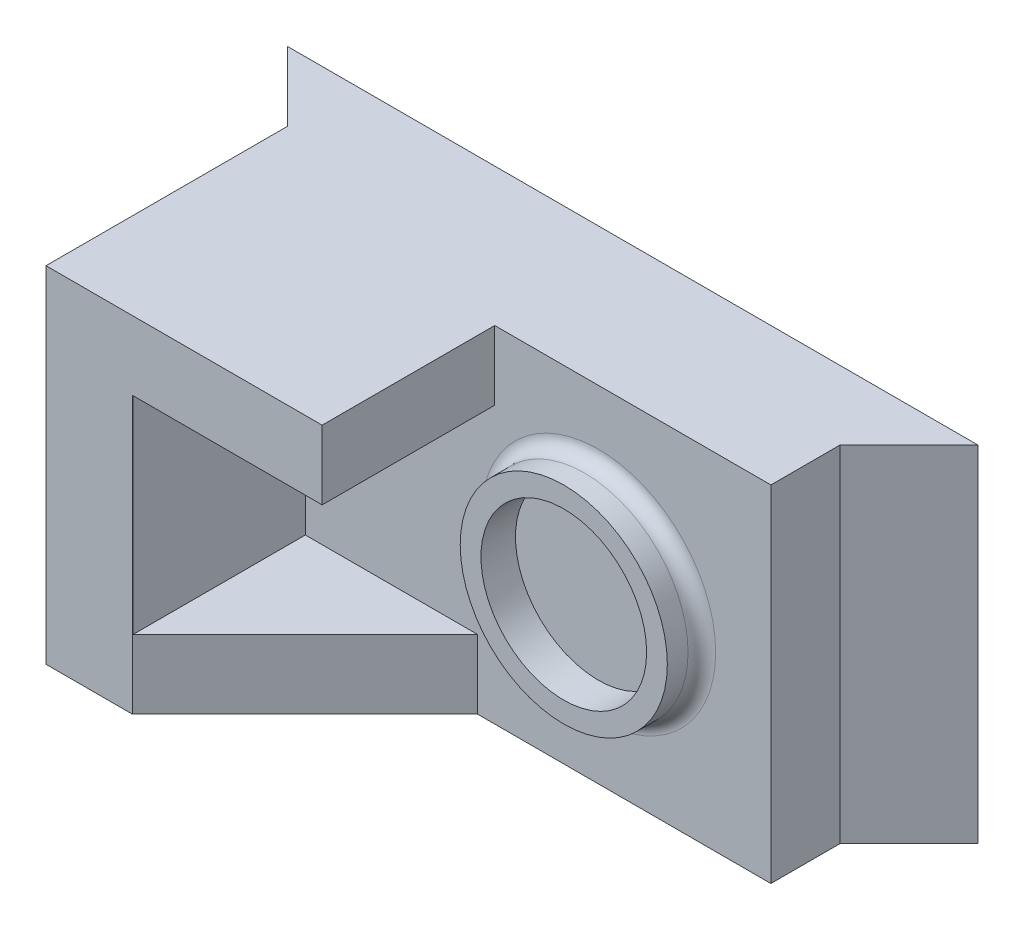
ISO-10303-21;
HEADER;
FILE_DESCRIPTION(('STEP AP214'),'2;1');
FILE_NAME('part.step','',(''),(''),'','','');
FILE_SCHEMA(('AUTOMOTIVE_DESIGN { 1 0 10303 214 1 1 1 1 }'));
ENDSEC;
DATA;
#1=APPLICATION_CONTEXT('core data for automotive mechanical design processes');
#2=APPLICATION_PROTOCOL_DEFINITION('international standard','automotive_design',2000,#1);
#3=PRODUCT_CONTEXT('',#1,'mechanical');
#4=PRODUCT('Part','Part','',(#3));
#5=PRODUCT_RELATED_PRODUCT_CATEGORY('part','',(#4));
#6=PRODUCT_DEFINITION_FORMATION('','',#4);
#7=PRODUCT_DEFINITION_CONTEXT('part definition',#1,'design');
#8=PRODUCT_DEFINITION('design','',#6,#7);
#9=PRODUCT_DEFINITION_SHAPE('','',#8);
#10=(LENGTH_UNIT() NAMED_UNIT(*) SI_UNIT(.MILLI.,.METRE.));
#11=(NAMED_UNIT(*) PLANE_ANGLE_UNIT() SI_UNIT($,.RADIAN.));
#12=(NAMED_UNIT(*) SI_UNIT($,.STERADIAN.) SOLID_ANGLE_UNIT());
#13=UNCERTAINTY_MEASURE_WITH_UNIT(LENGTH_MEASURE(1.E-05),#10,'distance_accuracy_value','');
#14=(GEOMETRIC_REPRESENTATION_CONTEXT(3) GLOBAL_UNCERTAINTY_ASSIGNED_CONTEXT((#13)) GLOBAL_UNIT_ASSIGNED_CONTEXT((#10,
#11,#12)) REPRESENTATION_CONTEXT('',''));
#15=CARTESIAN_POINT('',(0.,0.,0.));
#16=DIRECTION('',(0.,0.,1.));
#17=DIRECTION('',(1.,0.,0.));
#18=AXIS2_PLACEMENT_3D('',#15,#16,#17);
#19=CARTESIAN_POINT('',(0.,25.,45.));
#20=DIRECTION('',(-1.,0.,0.));
#21=DIRECTION('',(0.,0.,1.));
#22=AXIS2_PLACEMENT_3D('',#19,#20,#21);
#23=PLANE('',#22);
#24=DIRECTION('',(0.,1.,0.));
#25=VECTOR('',#24,1.);
#26=CARTESIAN_POINT('',(0.,25.,45.));
#27=LINE('',#26,#25);
#28=CARTESIAN_POINT('',(0.,15.,45.));
#29=VERTEX_POINT('',#28);
#30=CARTESIAN_POINT('',(0.,25.,45.));
#31=VERTEX_POINT('',#30);
#32=EDGE_CURVE('E189',#29,#31,#27,.T.);
#33=ORIENTED_EDGE('',*,*,#32,.F.);
#34=DIRECTION('',(0.,0.,-1.));
#35=VECTOR('',#34,1.);
#36=CARTESIAN_POINT('',(0.,15.,45.));
#37=LINE('',#36,#35);
#38=CARTESIAN_POINT('',(0.,15.,20.));
#39=VERTEX_POINT('',#38);
#40=EDGE_CURVE('E175',#29,#39,#37,.T.);
#41=ORIENTED_EDGE('',*,*,#40,.T.);
#42=DIRECTION('',(0.,1.,0.));
#43=VECTOR('',#42,1.);
#44=CARTESIAN_POINT('',(0.,25.,20.));
#45=LINE('',#44,#43);
#46=CARTESIAN_POINT('',(0.,25.,20.));
#47=VERTEX_POINT('',#46);
#48=EDGE_CURVE('E180',#39,#47,#45,.T.);
#49=ORIENTED_EDGE('',*,*,#48,.T.);
#50=DIRECTION('',(0.,0.,-1.));
#51=VECTOR('',#50,1.);
#52=CARTESIAN_POINT('',(0.,25.,45.));
#53=LINE('',#52,#51);
#54=EDGE_CURVE('E196',#31,#47,#53,.T.);
#55=ORIENTED_EDGE('',*,*,#54,.F.);
#56=EDGE_LOOP('',(#33,#41,#49,#55));
#57=FACE_BOUND('',#56,.T.);
#58=ADVANCED_FACE('F52',(#57),#23,.F.);
#59=CARTESIAN_POINT('',(-50.,25.,10.));
#60=DIRECTION('',(0.,-1.,0.));
#61=DIRECTION('',(1.,0.,0.));
#62=AXIS2_PLACEMENT_3D('',#59,#60,#61);
#63=PLANE('',#62);
#64=DIRECTION('',(-1.,0.,0.));
#65=VECTOR('',#64,1.);
#66=CARTESIAN_POINT('',(-50.,25.,0.));
#67=LINE('',#66,#65);
#68=CARTESIAN_POINT('',(50.,25.,0.));
#69=VERTEX_POINT('',#68);
#70=CARTESIAN_POINT('',(-50.,25.,0.));
#71=VERTEX_POINT('',#70);
#72=EDGE_CURVE('E240',#69,#71,#67,.T.);
#73=ORIENTED_EDGE('',*,*,#72,.T.);
#74=DIRECTION('',(0.707106781186546,0.,0.707106781186549));
#75=VECTOR('',#74,1.);
#76=CARTESIAN_POINT('',(-40.,25.,10.));
#77=LINE('',#76,#75);
#78=CARTESIAN_POINT('',(-40.,25.,10.));
#79=VERTEX_POINT('',#78);
#80=EDGE_CURVE('E266',#71,#79,#77,.T.);
#81=ORIENTED_EDGE('',*,*,#80,.T.);
#82=DIRECTION('',(0.,0.,-1.));
#83=VECTOR('',#82,1.);
#84=CARTESIAN_POINT('',(-40.,25.,20.));
#85=LINE('',#84,#83);
#86=CARTESIAN_POINT('',(-40.,25.,45.));
#87=VERTEX_POINT('',#86);
#88=EDGE_CURVE('E228',#87,#79,#85,.T.);
#89=ORIENTED_EDGE('',*,*,#88,.F.);
#90=DIRECTION('',(-1.,0.,0.));
#91=VECTOR('',#90,1.);
#92=CARTESIAN_POINT('',(-40.,25.,45.));
#93=LINE('',#92,#91);
#94=EDGE_CURVE('E192',#31,#87,#93,.T.);
#95=ORIENTED_EDGE('',*,*,#94,.F.);
#96=ORIENTED_EDGE('',*,*,#54,.T.);
#97=DIRECTION('',(-1.,0.,0.));
#98=VECTOR('',#97,1.);
#99=CARTESIAN_POINT('',(-40.,25.,20.));
#100=LINE('',#99,#98);
#101=CARTESIAN_POINT('',(40.,25.,20.));
#102=VERTEX_POINT('',#101);
#103=EDGE_CURVE('E207',#102,#47,#100,.T.);
#104=ORIENTED_EDGE('',*,*,#103,.F.);
#105=DIRECTION('',(0.,0.,-1.));
#106=VECTOR('',#105,1.);
#107=CARTESIAN_POINT('',(40.,25.,20.));
#108=LINE('',#107,#106);
#109=CARTESIAN_POINT('',(40.,25.,10.));
#110=VERTEX_POINT('',#109);
#111=EDGE_CURVE('E232',#102,#110,#108,.T.);
#112=ORIENTED_EDGE('',*,*,#111,.T.);
#113=DIRECTION('',(0.707106781186546,0.,-0.707106781186549));
#114=VECTOR('',#113,1.);
#115=CARTESIAN_POINT('',(40.,25.,10.));
#116=LINE('',#115,#114);
#117=EDGE_CURVE('E257',#110,#69,#116,.T.);
#118=ORIENTED_EDGE('',*,*,#117,.T.);
#119=EDGE_LOOP('',(#73,#81,#89,#95,#96,#104,#112,#118));
#120=FACE_BOUND('',#119,.T.);
#121=ADVANCED_FACE('F303',(#120),#63,.F.);
#122=CARTESIAN_POINT('',(-50.,-25.,10.));
#123=DIRECTION('',(0.,1.,0.));
#124=DIRECTION('',(0.,0.,1.));
#125=AXIS2_PLACEMENT_3D('',#122,#123,#124);
#126=PLANE('',#125);
#127=DIRECTION('',(1.,0.,0.));
#128=VECTOR('',#127,1.);
#129=CARTESIAN_POINT('',(-40.,-25.,20.));
#130=LINE('',#129,#128);
#131=CARTESIAN_POINT('',(-2.50000000000022,-25.,20.));
#132=VERTEX_POINT('',#131);
#133=CARTESIAN_POINT('',(40.,-25.,20.));
#134=VERTEX_POINT('',#133);
#135=EDGE_CURVE('E69',#132,#134,#130,.T.);
#136=ORIENTED_EDGE('',*,*,#135,.F.);
#137=DIRECTION('',(-0.707106781186551,0.,0.707106781186544));
#138=VECTOR('',#137,1.);
#139=CARTESIAN_POINT('',(-27.5000000000005,-25.,45.));
#140=LINE('',#139,#138);
#141=CARTESIAN_POINT('',(-27.5000000000005,-25.,45.));
#142=VERTEX_POINT('',#141);
#143=EDGE_CURVE('E285',#132,#142,#140,.T.);
#144=ORIENTED_EDGE('',*,*,#143,.T.);
#145=DIRECTION('',(1.,0.,0.));
#146=VECTOR('',#145,1.);
#147=CARTESIAN_POINT('',(-40.,-25.,45.));
#148=LINE('',#147,#146);
#149=CARTESIAN_POINT('',(-40.,-25.,45.));
#150=VERTEX_POINT('',#149);
#151=EDGE_CURVE('E185',#150,#142,#148,.T.);
#152=ORIENTED_EDGE('',*,*,#151,.F.);
#153=DIRECTION('',(0.,0.,-1.));
#154=VECTOR('',#153,1.);
#155=CARTESIAN_POINT('',(-40.,-25.,20.));
#156=LINE('',#155,#154);
#157=CARTESIAN_POINT('',(-40.,-25.,10.));
#158=VERTEX_POINT('',#157);
#159=EDGE_CURVE('E224',#150,#158,#156,.T.);
#160=ORIENTED_EDGE('',*,*,#159,.T.);
#161=DIRECTION('',(-0.707106781186546,0.,-0.707106781186549));
#162=VECTOR('',#161,1.);
#163=CARTESIAN_POINT('',(-40.,-25.,10.));
#164=LINE('',#163,#162);
#165=CARTESIAN_POINT('',(-50.,-25.,0.));
#166=VERTEX_POINT('',#165);
#167=EDGE_CURVE('E263',#158,#166,#164,.T.);
#168=ORIENTED_EDGE('',*,*,#167,.T.);
#169=DIRECTION('',(1.,0.,0.));
#170=VECTOR('',#169,1.);
#171=CARTESIAN_POINT('',(-50.,-25.,0.));
#172=LINE('',#171,#170);
#173=CARTESIAN_POINT('',(50.,-25.,0.));
#174=VERTEX_POINT('',#173);
#175=EDGE_CURVE('E247',#166,#174,#172,.T.);
#176=ORIENTED_EDGE('',*,*,#175,.T.);
#177=DIRECTION('',(-0.707106781186546,0.,0.707106781186549));
#178=VECTOR('',#177,1.);
#179=CARTESIAN_POINT('',(40.,-25.,10.));
#180=LINE('',#179,#178);
#181=CARTESIAN_POINT('',(40.,-25.,10.));
#182=VERTEX_POINT('',#181);
#183=EDGE_CURVE('E260',#174,#182,#180,.T.);
#184=ORIENTED_EDGE('',*,*,#183,.T.);
#185=DIRECTION('',(0.,0.,-1.));
#186=VECTOR('',#185,1.);
#187=CARTESIAN_POINT('',(40.,-25.,20.));
#188=LINE('',#187,#186);
#189=EDGE_CURVE('E214',#134,#182,#188,.T.);
#190=ORIENTED_EDGE('',*,*,#189,.F.);
#191=EDGE_LOOP('',(#136,#144,#152,#160,#168,#176,#184,#190));
#192=FACE_BOUND('',#191,.T.);
#193=ADVANCED_FACE('F297',(#192),#126,.F.);
#194=CARTESIAN_POINT('',(0.,0.,0.));
#195=DIRECTION('',(0.,0.,1.));
#196=DIRECTION('',(1.,0.,0.));
#197=AXIS2_PLACEMENT_3D('',#194,#195,#196);
#198=PLANE('',#197);
#199=DIRECTION('',(0.,1.,0.));
#200=VECTOR('',#199,1.);
#201=CARTESIAN_POINT('',(50.,25.,0.));
#202=LINE('',#201,#200);
#203=EDGE_CURVE('E236',#174,#69,#202,.T.);
#204=ORIENTED_EDGE('',*,*,#203,.F.);
#205=ORIENTED_EDGE('',*,*,#175,.F.);
#206=DIRECTION('',(0.,-1.,0.));
#207=VECTOR('',#206,1.);
#208=CARTESIAN_POINT('',(-50.,25.,0.));
#209=LINE('',#208,#207);
#210=EDGE_CURVE('E243',#71,#166,#209,.T.);
#211=ORIENTED_EDGE('',*,*,#210,.F.);
#212=ORIENTED_EDGE('',*,*,#72,.F.);
#213=EDGE_LOOP('',(#204,#205,#211,#212));
#214=FACE_BOUND('',#213,.T.);
#215=ADVANCED_FACE('F323',(#214),#198,.F.);
#216=CARTESIAN_POINT('',(40.,25.,20.));
#217=DIRECTION('',(-1.,0.,0.));
#218=DIRECTION('',(0.,0.,1.));
#219=AXIS2_PLACEMENT_3D('',#216,#217,#218);
#220=PLANE('',#219);
#221=DIRECTION('',(0.,1.,0.));
#222=VECTOR('',#221,1.);
#223=CARTESIAN_POINT('',(40.,25.,10.));
#224=LINE('',#223,#222);
#225=EDGE_CURVE('E202',#182,#110,#224,.T.);
#226=ORIENTED_EDGE('',*,*,#225,.T.);
#227=ORIENTED_EDGE('',*,*,#111,.F.);
#228=DIRECTION('',(0.,1.,0.));
#229=VECTOR('',#228,1.);
#230=CARTESIAN_POINT('',(40.,25.,20.));
#231=LINE('',#230,#229);
#232=EDGE_CURVE('E203',#134,#102,#231,.T.);
#233=ORIENTED_EDGE('',*,*,#232,.F.);
#234=ORIENTED_EDGE('',*,*,#189,.T.);
#235=EDGE_LOOP('',(#226,#227,#233,#234));
#236=FACE_BOUND('',#235,.T.);
#237=ADVANCED_FACE('F301',(#236),#220,.F.);
#238=CARTESIAN_POINT('',(-40.,25.,20.));
#239=DIRECTION('',(1.,0.,0.));
#240=DIRECTION('',(0.,1.,0.));
#241=AXIS2_PLACEMENT_3D('',#238,#239,#240);
#242=PLANE('',#241);
#243=DIRECTION('',(0.,-1.,0.));
#244=VECTOR('',#243,1.);
#245=CARTESIAN_POINT('',(-40.,25.,10.));
#246=LINE('',#245,#244);
#247=EDGE_CURVE('E208',#79,#158,#246,.T.);
#248=ORIENTED_EDGE('',*,*,#247,.T.);
#249=ORIENTED_EDGE('',*,*,#159,.F.);
#250=DIRECTION('',(0.,-1.,0.));
#251=VECTOR('',#250,1.);
#252=CARTESIAN_POINT('',(-40.,25.,45.));
#253=LINE('',#252,#251);
#254=EDGE_CURVE('E181',#87,#150,#253,.T.);
#255=ORIENTED_EDGE('',*,*,#254,.F.);
#256=ORIENTED_EDGE('',*,*,#88,.T.);
#257=EDGE_LOOP('',(#248,#249,#255,#256));
#258=FACE_BOUND('',#257,.T.);
#259=ADVANCED_FACE('F315',(#258),#242,.F.);
#260=CARTESIAN_POINT('',(0.,0.,20.));
#261=DIRECTION('',(0.,0.,1.));
#262=DIRECTION('',(1.,0.,0.));
#263=AXIS2_PLACEMENT_3D('',#260,#261,#262);
#264=PLANE('',#263);
#265=CARTESIAN_POINT('',(15.,0.,20.));
#266=DIRECTION('',(0.,0.,1.));
#267=DIRECTION('',(1.,0.,0.));
#268=AXIS2_PLACEMENT_3D('',#265,#266,#267);
#269=CIRCLE('',#268,17.);
#270=CARTESIAN_POINT('',(32.,0.,20.));
#271=VERTEX_POINT('',#270);
#272=EDGE_CURVE('E273',#271,#271,#269,.F.);
#273=ORIENTED_EDGE('',*,*,#272,.T.);
#274=EDGE_LOOP('',(#273));
#275=FACE_BOUND('',#274,.T.);
#276=ORIENTED_EDGE('',*,*,#48,.F.);
#277=DIRECTION('',(-1.,0.,0.));
#278=VECTOR('',#277,1.);
#279=CARTESIAN_POINT('',(-27.4349572172728,15.,20.));
#280=LINE('',#279,#278);
#281=CARTESIAN_POINT('',(-27.4349572172728,15.,20.));
#282=VERTEX_POINT('',#281);
#283=EDGE_CURVE('E150',#39,#282,#280,.T.);
#284=ORIENTED_EDGE('',*,*,#283,.T.);
#285=DIRECTION('',(0.,-1.,0.));
#286=VECTOR('',#285,1.);
#287=CARTESIAN_POINT('',(-27.4349572172728,15.,20.));
#288=LINE('',#287,#286);
#289=CARTESIAN_POINT('',(-27.4349572172728,-15.,20.));
#290=VERTEX_POINT('',#289);
#291=EDGE_CURVE('E143',#282,#290,#288,.T.);
#292=ORIENTED_EDGE('',*,*,#291,.T.);
#293=DIRECTION('',(1.,0.,0.));
#294=VECTOR('',#293,1.);
#295=CARTESIAN_POINT('',(-27.4349572172728,-15.,20.));
#296=LINE('',#295,#294);
#297=CARTESIAN_POINT('',(-2.50000000000022,-15.,20.));
#298=VERTEX_POINT('',#297);
#299=EDGE_CURVE('E153',#290,#298,#296,.T.);
#300=ORIENTED_EDGE('',*,*,#299,.T.);
#301=DIRECTION('',(0.,-1.,0.));
#302=VECTOR('',#301,1.);
#303=CARTESIAN_POINT('',(-2.50000000000022,0.,20.));
#304=LINE('',#303,#302);
#305=EDGE_CURVE('E11',#298,#132,#304,.T.);
#306=ORIENTED_EDGE('',*,*,#305,.T.);
#307=ORIENTED_EDGE('',*,*,#135,.T.);
#308=ORIENTED_EDGE('',*,*,#232,.T.);
#309=ORIENTED_EDGE('',*,*,#103,.T.);
#310=EDGE_LOOP('',(#276,#284,#292,#300,#306,#307,#308,#309));
#311=FACE_BOUND('',#310,.T.);
#312=ADVANCED_FACE('F161',(#275,#311),#264,.T.);
#313=CARTESIAN_POINT('',(0.,0.,45.));
#314=DIRECTION('',(0.,0.,1.));
#315=DIRECTION('',(1.,0.,0.));
#316=AXIS2_PLACEMENT_3D('',#313,#314,#315);
#317=PLANE('',#316);
#318=ORIENTED_EDGE('',*,*,#151,.T.);
#319=DIRECTION('',(0.,1.,0.));
#320=VECTOR('',#319,1.);
#321=CARTESIAN_POINT('',(-27.5000000000005,-15.,45.));
#322=LINE('',#321,#320);
#323=CARTESIAN_POINT('',(-27.5000000000005,15.,45.));
#324=VERTEX_POINT('',#323);
#325=EDGE_CURVE('E277',#142,#324,#322,.T.);
#326=ORIENTED_EDGE('',*,*,#325,.T.);
#327=DIRECTION('',(-1.,0.,0.));
#328=VECTOR('',#327,1.);
#329=CARTESIAN_POINT('',(0.,15.,45.));
#330=LINE('',#329,#328);
#331=EDGE_CURVE('E250',#29,#324,#330,.T.);
#332=ORIENTED_EDGE('',*,*,#331,.F.);
#333=ORIENTED_EDGE('',*,*,#32,.T.);
#334=ORIENTED_EDGE('',*,*,#94,.T.);
#335=ORIENTED_EDGE('',*,*,#254,.T.);
#336=EDGE_LOOP('',(#318,#326,#332,#333,#334,#335));
#337=FACE_BOUND('',#336,.T.);
#338=ADVANCED_FACE('F310',(#337),#317,.T.);
#339=CARTESIAN_POINT('',(-27.4349572172728,15.,20.));
#340=DIRECTION('',(0.,1.,0.));
#341=DIRECTION('',(0.,0.,1.));
#342=AXIS2_PLACEMENT_3D('',#339,#340,#341);
#343=PLANE('',#342);
#344=ORIENTED_EDGE('',*,*,#331,.T.);
#345=DIRECTION('',(0.707106781186551,0.,-0.707106781186544));
#346=VECTOR('',#345,1.);
#347=CARTESIAN_POINT('',(-14.9674786086366,15.,32.4674786086363));
#348=LINE('',#347,#346);
#349=CARTESIAN_POINT('',(-27.4349572172728,15.,44.9349572172723));
#350=VERTEX_POINT('',#349);
#351=EDGE_CURVE('E63',#324,#350,#348,.T.);
#352=ORIENTED_EDGE('',*,*,#351,.T.);
#353=DIRECTION('',(0.,0.,1.));
#354=VECTOR('',#353,1.);
#355=CARTESIAN_POINT('',(-27.4349572172728,15.,20.));
#356=LINE('',#355,#354);
#357=EDGE_CURVE('E149',#282,#350,#356,.T.);
#358=ORIENTED_EDGE('',*,*,#357,.F.);
#359=ORIENTED_EDGE('',*,*,#283,.F.);
#360=ORIENTED_EDGE('',*,*,#40,.F.);
#361=EDGE_LOOP('',(#344,#352,#358,#359,#360));
#362=FACE_BOUND('',#361,.T.);
#363=ADVANCED_FACE('F290',(#362),#343,.F.);
#364=CARTESIAN_POINT('',(-27.4349572172728,-15.,20.));
#365=DIRECTION('',(0.,-1.,0.));
#366=DIRECTION('',(0.,0.,-1.));
#367=AXIS2_PLACEMENT_3D('',#364,#365,#366);
#368=PLANE('',#367);
#369=DIRECTION('',(0.,0.,1.));
#370=VECTOR('',#369,1.);
#371=CARTESIAN_POINT('',(-27.4349572172728,-15.,20.));
#372=LINE('',#371,#370);
#373=CARTESIAN_POINT('',(-27.4349572172728,-15.,44.9349572172723));
#374=VERTEX_POINT('',#373);
#375=EDGE_CURVE('E138',#290,#374,#372,.T.);
#376=ORIENTED_EDGE('',*,*,#375,.T.);
#377=DIRECTION('',(0.707106781186551,0.,-0.707106781186544));
#378=VECTOR('',#377,1.);
#379=CARTESIAN_POINT('',(-27.5000000000005,-15.,45.));
#380=LINE('',#379,#378);
#381=EDGE_CURVE('E155',#374,#298,#380,.T.);
#382=ORIENTED_EDGE('',*,*,#381,.T.);
#383=ORIENTED_EDGE('',*,*,#299,.F.);
#384=EDGE_LOOP('',(#376,#382,#383));
#385=FACE_BOUND('',#384,.T.);
#386=ADVANCED_FACE('F154',(#385),#368,.F.);
#387=CARTESIAN_POINT('',(-27.4349572172728,15.,20.));
#388=DIRECTION('',(-1.,0.,0.));
#389=DIRECTION('',(0.,-1.,0.));
#390=AXIS2_PLACEMENT_3D('',#387,#388,#389);
#391=PLANE('',#390);
#392=ORIENTED_EDGE('',*,*,#357,.T.);
#393=DIRECTION('',(0.,-1.,0.));
#394=VECTOR('',#393,1.);
#395=CARTESIAN_POINT('',(-27.4349572172728,0.,44.9349572172723));
#396=LINE('',#395,#394);
#397=EDGE_CURVE('E145',#350,#374,#396,.T.);
#398=ORIENTED_EDGE('',*,*,#397,.T.);
#399=ORIENTED_EDGE('',*,*,#375,.F.);
#400=ORIENTED_EDGE('',*,*,#291,.F.);
#401=EDGE_LOOP('',(#392,#398,#399,#400));
#402=FACE_BOUND('',#401,.T.);
#403=ADVANCED_FACE('F141',(#402),#391,.F.);
#404=CARTESIAN_POINT('',(15.,0.,25.));
#405=DIRECTION('',(0.,0.,1.));
#406=DIRECTION('',(1.,0.,0.));
#407=AXIS2_PLACEMENT_3D('',#404,#405,#406);
#408=PLANE('',#407);
#409=CARTESIAN_POINT('',(15.,0.,25.));
#410=DIRECTION('',(0.,0.,1.));
#411=DIRECTION('',(1.,0.,0.));
#412=AXIS2_PLACEMENT_3D('',#409,#410,#411);
#413=CIRCLE('',#412,15.);
#414=CARTESIAN_POINT('',(30.,0.,25.));
#415=VERTEX_POINT('',#414);
#416=EDGE_CURVE('E164',#415,#415,#413,.T.);
#417=ORIENTED_EDGE('',*,*,#416,.T.);
#418=EDGE_LOOP('',(#417));
#419=FACE_BOUND('',#418,.T.);
#420=CARTESIAN_POINT('',(15.,0.,25.));
#421=DIRECTION('',(0.,0.,1.));
#422=DIRECTION('',(1.,0.,0.));
#423=AXIS2_PLACEMENT_3D('',#420,#421,#422);
#424=CIRCLE('',#423,12.);
#425=CARTESIAN_POINT('',(27.,0.,25.));
#426=VERTEX_POINT('',#425);
#427=EDGE_CURVE('E168',#426,#426,#424,.T.);
#428=ORIENTED_EDGE('',*,*,#427,.F.);
#429=EDGE_LOOP('',(#428));
#430=FACE_BOUND('',#429,.T.);
#431=ADVANCED_FACE('F375',(#419,#430),#408,.T.);
#432=CARTESIAN_POINT('',(15.,0.,25.));
#433=DIRECTION('',(0.,0.,-1.));
#434=DIRECTION('',(-1.,0.,0.));
#435=AXIS2_PLACEMENT_3D('',#432,#433,#434);
#436=CYLINDRICAL_SURFACE('',#435,15.);
#437=CARTESIAN_POINT('',(15.,0.,22.));
#438=DIRECTION('',(0.,0.,1.));
#439=DIRECTION('',(1.,0.,0.));
#440=AXIS2_PLACEMENT_3D('',#437,#438,#439);
#441=CIRCLE('',#440,15.);
#442=CARTESIAN_POINT('',(30.,0.,22.));
#443=VERTEX_POINT('',#442);
#444=EDGE_CURVE('E269',#443,#443,#441,.T.);
#445=ORIENTED_EDGE('',*,*,#444,.T.);
#446=EDGE_LOOP('',(#445));
#447=FACE_BOUND('',#446,.T.);
#448=ORIENTED_EDGE('',*,*,#416,.F.);
#449=EDGE_LOOP('',(#448));
#450=FACE_BOUND('',#449,.T.);
#451=ADVANCED_FACE('F381',(#447,#450),#436,.T.);
#452=CARTESIAN_POINT('',(15.,0.,25.));
#453=DIRECTION('',(0.,0.,-1.));
#454=DIRECTION('',(-1.,0.,0.));
#455=AXIS2_PLACEMENT_3D('',#452,#453,#454);
#456=CYLINDRICAL_SURFACE('',#455,12.);
#457=ORIENTED_EDGE('',*,*,#427,.T.);
#458=EDGE_LOOP('',(#457));
#459=FACE_BOUND('',#458,.T.);
#460=CARTESIAN_POINT('',(15.,0.,20.));
#461=DIRECTION('',(0.,0.,1.));
#462=DIRECTION('',(1.,0.,0.));
#463=AXIS2_PLACEMENT_3D('',#460,#461,#462);
#464=CIRCLE('',#463,12.);
#465=CARTESIAN_POINT('',(27.,0.,20.));
#466=VERTEX_POINT('',#465);
#467=EDGE_CURVE('E253',#466,#466,#464,.F.);
#468=ORIENTED_EDGE('',*,*,#467,.T.);
#469=EDGE_LOOP('',(#468));
#470=FACE_BOUND('',#469,.T.);
#471=ADVANCED_FACE('F337',(#459,#470),#456,.F.);
#472=ORIENTED_EDGE('',*,*,#467,.F.);
#473=EDGE_LOOP('',(#472));
#474=FACE_BOUND('',#473,.T.);
#475=ADVANCED_FACE('F327',(#474),#264,.T.);
#476=CARTESIAN_POINT('',(40.,0.,10.));
#477=DIRECTION('',(0.707106781186549,0.,0.707106781186546));
#478=DIRECTION('',(0.,-1.,0.));
#479=AXIS2_PLACEMENT_3D('',#476,#477,#478);
#480=PLANE('',#479);
#481=ORIENTED_EDGE('',*,*,#183,.F.);
#482=ORIENTED_EDGE('',*,*,#203,.T.);
#483=ORIENTED_EDGE('',*,*,#117,.F.);
#484=ORIENTED_EDGE('',*,*,#225,.F.);
#485=EDGE_LOOP('',(#481,#482,#483,#484));
#486=FACE_BOUND('',#485,.T.);
#487=ADVANCED_FACE('F325',(#486),#480,.T.);
#488=CARTESIAN_POINT('',(-40.,0.,10.));
#489=DIRECTION('',(-0.707106781186549,0.,0.707106781186546));
#490=DIRECTION('',(0.,1.,0.));
#491=AXIS2_PLACEMENT_3D('',#488,#489,#490);
#492=PLANE('',#491);
#493=ORIENTED_EDGE('',*,*,#80,.F.);
#494=ORIENTED_EDGE('',*,*,#210,.T.);
#495=ORIENTED_EDGE('',*,*,#167,.F.);
#496=ORIENTED_EDGE('',*,*,#247,.F.);
#497=EDGE_LOOP('',(#493,#494,#495,#496));
#498=FACE_BOUND('',#497,.T.);
#499=ADVANCED_FACE('F319',(#498),#492,.T.);
#500=CARTESIAN_POINT('',(15.,0.,22.));
#501=DIRECTION('',(0.,0.,1.));
#502=DIRECTION('',(1.,0.,0.));
#503=AXIS2_PLACEMENT_3D('',#500,#501,#502);
#504=TOROIDAL_SURFACE('',#503,17.,2.);
#505=ORIENTED_EDGE('',*,*,#272,.F.);
#506=EDGE_LOOP('',(#505));
#507=FACE_BOUND('',#506,.T.);
#508=ORIENTED_EDGE('',*,*,#444,.F.);
#509=EDGE_LOOP('',(#508));
#510=FACE_BOUND('',#509,.T.);
#511=ADVANCED_FACE('F334',(#507,#510),#504,.F.);
#512=CARTESIAN_POINT('',(-27.5000000000005,0.,45.));
#513=DIRECTION('',(0.707106781186544,0.,0.707106781186551));
#514=DIRECTION('',(0.,-1.,0.));
#515=AXIS2_PLACEMENT_3D('',#512,#513,#514);
#516=PLANE('',#515);
#517=ORIENTED_EDGE('',*,*,#143,.F.);
#518=ORIENTED_EDGE('',*,*,#305,.F.);
#519=ORIENTED_EDGE('',*,*,#381,.F.);
#520=ORIENTED_EDGE('',*,*,#397,.F.);
#521=ORIENTED_EDGE('',*,*,#351,.F.);
#522=ORIENTED_EDGE('',*,*,#325,.F.);
#523=EDGE_LOOP('',(#517,#518,#519,#520,#521,#522));
#524=FACE_BOUND('',#523,.T.);
#525=ADVANCED_FACE('F55',(#524),#516,.T.);
#526=CLOSED_SHELL('',(#58,#121,#193,#215,#237,#259,#312,#338,#363,#386,#403,#431,#451,#471,#475,
#487,#499,#511,#525));
#527=MANIFOLD_SOLID_BREP('B2',#526);
#528=ADVANCED_BREP_SHAPE_REPRESENTATION('',(#18,#527),#14);
#529=SHAPE_DEFINITION_REPRESENTATION(#9,#528);
ENDSEC;
END-ISO-10303-21;
